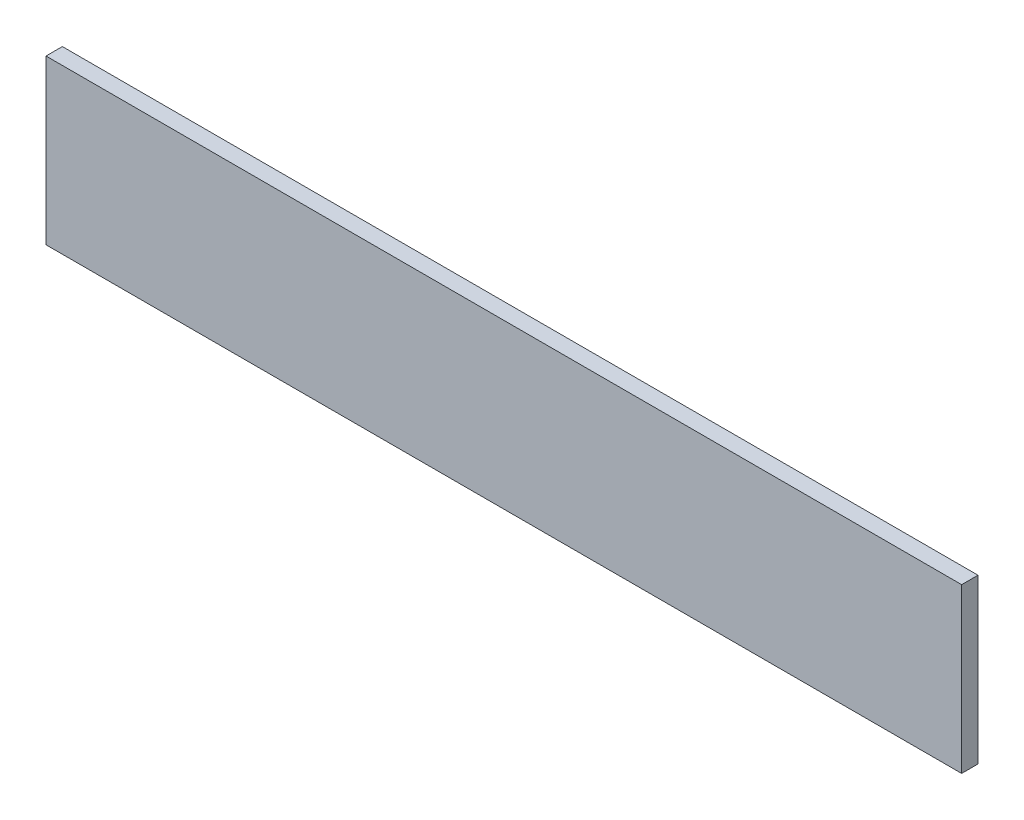
ISO-10303-21;
HEADER;
FILE_DESCRIPTION(('STEP AP214'),'2;1');
FILE_NAME('part.step','',(''),(''),'','','');
FILE_SCHEMA(('AUTOMOTIVE_DESIGN { 1 0 10303 214 1 1 1 1 }'));
ENDSEC;
DATA;
#1=APPLICATION_CONTEXT('core data for automotive mechanical design processes');
#2=APPLICATION_PROTOCOL_DEFINITION('international standard','automotive_design',2000,#1);
#3=PRODUCT_CONTEXT('',#1,'mechanical');
#4=PRODUCT('Part','Part','',(#3));
#5=PRODUCT_RELATED_PRODUCT_CATEGORY('part','',(#4));
#6=PRODUCT_DEFINITION_FORMATION('','',#4);
#7=PRODUCT_DEFINITION_CONTEXT('part definition',#1,'design');
#8=PRODUCT_DEFINITION('design','',#6,#7);
#9=PRODUCT_DEFINITION_SHAPE('','',#8);
#10=(LENGTH_UNIT() NAMED_UNIT(*) SI_UNIT(.MILLI.,.METRE.));
#11=(NAMED_UNIT(*) PLANE_ANGLE_UNIT() SI_UNIT($,.RADIAN.));
#12=(NAMED_UNIT(*) SI_UNIT($,.STERADIAN.) SOLID_ANGLE_UNIT());
#13=UNCERTAINTY_MEASURE_WITH_UNIT(LENGTH_MEASURE(1.E-05),#10,'distance_accuracy_value','');
#14=(GEOMETRIC_REPRESENTATION_CONTEXT(3) GLOBAL_UNCERTAINTY_ASSIGNED_CONTEXT((#13)) GLOBAL_UNIT_ASSIGNED_CONTEXT((#10,
#11,#12)) REPRESENTATION_CONTEXT('',''));
#15=CARTESIAN_POINT('',(0.,0.,0.));
#16=DIRECTION('',(0.,0.,1.));
#17=DIRECTION('',(1.,0.,0.));
#18=AXIS2_PLACEMENT_3D('',#15,#16,#17);
#19=CARTESIAN_POINT('',(140.,-25.,5.));
#20=DIRECTION('',(-1.,0.,0.));
#21=DIRECTION('',(0.,0.,1.));
#22=AXIS2_PLACEMENT_3D('',#19,#20,#21);
#23=PLANE('',#22);
#24=DIRECTION('',(0.,1.,0.));
#25=VECTOR('',#24,1.);
#26=CARTESIAN_POINT('',(140.,-25.,0.));
#27=LINE('',#26,#25);
#28=CARTESIAN_POINT('',(140.,-25.,0.));
#29=VERTEX_POINT('',#28);
#30=CARTESIAN_POINT('',(140.,25.,0.));
#31=VERTEX_POINT('',#30);
#32=EDGE_CURVE('E98',#29,#31,#27,.T.);
#33=ORIENTED_EDGE('',*,*,#32,.T.);
#34=DIRECTION('',(0.,0.,-1.));
#35=VECTOR('',#34,1.);
#36=CARTESIAN_POINT('',(140.,25.,5.));
#37=LINE('',#36,#35);
#38=CARTESIAN_POINT('',(140.,25.,5.));
#39=VERTEX_POINT('',#38);
#40=EDGE_CURVE('E11',#39,#31,#37,.T.);
#41=ORIENTED_EDGE('',*,*,#40,.F.);
#42=DIRECTION('',(0.,1.,0.));
#43=VECTOR('',#42,1.);
#44=CARTESIAN_POINT('',(140.,-25.,5.));
#45=LINE('',#44,#43);
#46=CARTESIAN_POINT('',(140.,-25.,5.));
#47=VERTEX_POINT('',#46);
#48=EDGE_CURVE('E86',#47,#39,#45,.T.);
#49=ORIENTED_EDGE('',*,*,#48,.F.);
#50=DIRECTION('',(0.,0.,-1.));
#51=VECTOR('',#50,1.);
#52=CARTESIAN_POINT('',(140.,-25.,5.));
#53=LINE('',#52,#51);
#54=EDGE_CURVE('E94',#47,#29,#53,.T.);
#55=ORIENTED_EDGE('',*,*,#54,.T.);
#56=EDGE_LOOP('',(#33,#41,#49,#55));
#57=FACE_BOUND('',#56,.T.);
#58=ADVANCED_FACE('F35',(#57),#23,.F.);
#59=CARTESIAN_POINT('',(-140.,25.,5.));
#60=DIRECTION('',(0.,-1.,0.));
#61=DIRECTION('',(0.,0.,-1.));
#62=AXIS2_PLACEMENT_3D('',#59,#60,#61);
#63=PLANE('',#62);
#64=DIRECTION('',(-1.,0.,0.));
#65=VECTOR('',#64,1.);
#66=CARTESIAN_POINT('',(-140.,25.,0.));
#67=LINE('',#66,#65);
#68=CARTESIAN_POINT('',(-140.,25.,0.));
#69=VERTEX_POINT('',#68);
#70=EDGE_CURVE('E90',#31,#69,#67,.T.);
#71=ORIENTED_EDGE('',*,*,#70,.T.);
#72=DIRECTION('',(0.,0.,-1.));
#73=VECTOR('',#72,1.);
#74=CARTESIAN_POINT('',(-140.,25.,5.));
#75=LINE('',#74,#73);
#76=CARTESIAN_POINT('',(-140.,25.,5.));
#77=VERTEX_POINT('',#76);
#78=EDGE_CURVE('E43',#77,#69,#75,.T.);
#79=ORIENTED_EDGE('',*,*,#78,.F.);
#80=DIRECTION('',(-1.,0.,0.));
#81=VECTOR('',#80,1.);
#82=CARTESIAN_POINT('',(-140.,25.,5.));
#83=LINE('',#82,#81);
#84=EDGE_CURVE('E81',#39,#77,#83,.T.);
#85=ORIENTED_EDGE('',*,*,#84,.F.);
#86=ORIENTED_EDGE('',*,*,#40,.T.);
#87=EDGE_LOOP('',(#71,#79,#85,#86));
#88=FACE_BOUND('',#87,.T.);
#89=ADVANCED_FACE('F89',(#88),#63,.F.);
#90=CARTESIAN_POINT('',(-140.,-25.,5.));
#91=DIRECTION('',(1.,0.,0.));
#92=DIRECTION('',(0.,0.,-1.));
#93=AXIS2_PLACEMENT_3D('',#90,#91,#92);
#94=PLANE('',#93);
#95=DIRECTION('',(0.,-1.,0.));
#96=VECTOR('',#95,1.);
#97=CARTESIAN_POINT('',(-140.,-25.,0.));
#98=LINE('',#97,#96);
#99=CARTESIAN_POINT('',(-140.,-25.,0.));
#100=VERTEX_POINT('',#99);
#101=EDGE_CURVE('E68',#69,#100,#98,.T.);
#102=ORIENTED_EDGE('',*,*,#101,.T.);
#103=DIRECTION('',(0.,0.,-1.));
#104=VECTOR('',#103,1.);
#105=CARTESIAN_POINT('',(-140.,-25.,5.));
#106=LINE('',#105,#104);
#107=CARTESIAN_POINT('',(-140.,-25.,5.));
#108=VERTEX_POINT('',#107);
#109=EDGE_CURVE('E91',#108,#100,#106,.T.);
#110=ORIENTED_EDGE('',*,*,#109,.F.);
#111=DIRECTION('',(0.,-1.,0.));
#112=VECTOR('',#111,1.);
#113=CARTESIAN_POINT('',(-140.,-25.,5.));
#114=LINE('',#113,#112);
#115=EDGE_CURVE('E84',#77,#108,#114,.T.);
#116=ORIENTED_EDGE('',*,*,#115,.F.);
#117=ORIENTED_EDGE('',*,*,#78,.T.);
#118=EDGE_LOOP('',(#102,#110,#116,#117));
#119=FACE_BOUND('',#118,.T.);
#120=ADVANCED_FACE('F92',(#119),#94,.F.);
#121=CARTESIAN_POINT('',(-140.,-25.,5.));
#122=DIRECTION('',(0.,1.,0.));
#123=DIRECTION('',(0.,0.,1.));
#124=AXIS2_PLACEMENT_3D('',#121,#122,#123);
#125=PLANE('',#124);
#126=DIRECTION('',(1.,0.,0.));
#127=VECTOR('',#126,1.);
#128=CARTESIAN_POINT('',(-140.,-25.,0.));
#129=LINE('',#128,#127);
#130=EDGE_CURVE('E74',#100,#29,#129,.T.);
#131=ORIENTED_EDGE('',*,*,#130,.T.);
#132=ORIENTED_EDGE('',*,*,#54,.F.);
#133=DIRECTION('',(1.,0.,0.));
#134=VECTOR('',#133,1.);
#135=CARTESIAN_POINT('',(-140.,-25.,5.));
#136=LINE('',#135,#134);
#137=EDGE_CURVE('E51',#108,#47,#136,.T.);
#138=ORIENTED_EDGE('',*,*,#137,.F.);
#139=ORIENTED_EDGE('',*,*,#109,.T.);
#140=EDGE_LOOP('',(#131,#132,#138,#139));
#141=FACE_BOUND('',#140,.T.);
#142=ADVANCED_FACE('F105',(#141),#125,.F.);
#143=CARTESIAN_POINT('',(0.,0.,5.));
#144=DIRECTION('',(0.,0.,-1.));
#145=DIRECTION('',(-1.,0.,0.));
#146=AXIS2_PLACEMENT_3D('',#143,#144,#145);
#147=PLANE('',#146);
#148=ORIENTED_EDGE('',*,*,#48,.T.);
#149=ORIENTED_EDGE('',*,*,#84,.T.);
#150=ORIENTED_EDGE('',*,*,#115,.T.);
#151=ORIENTED_EDGE('',*,*,#137,.T.);
#152=EDGE_LOOP('',(#148,#149,#150,#151));
#153=FACE_BOUND('',#152,.T.);
#154=ADVANCED_FACE('F82',(#153),#147,.F.);
#155=CARTESIAN_POINT('',(0.,0.,0.));
#156=DIRECTION('',(0.,0.,-1.));
#157=DIRECTION('',(-1.,0.,0.));
#158=AXIS2_PLACEMENT_3D('',#155,#156,#157);
#159=PLANE('',#158);
#160=ORIENTED_EDGE('',*,*,#32,.F.);
#161=ORIENTED_EDGE('',*,*,#130,.F.);
#162=ORIENTED_EDGE('',*,*,#101,.F.);
#163=ORIENTED_EDGE('',*,*,#70,.F.);
#164=EDGE_LOOP('',(#160,#161,#162,#163));
#165=FACE_BOUND('',#164,.T.);
#166=ADVANCED_FACE('F108',(#165),#159,.T.);
#167=CLOSED_SHELL('',(#58,#89,#120,#142,#154,#166));
#168=MANIFOLD_SOLID_BREP('B2',#167);
#169=ADVANCED_BREP_SHAPE_REPRESENTATION('',(#18,#168),#14);
#170=SHAPE_DEFINITION_REPRESENTATION(#9,#169);
ENDSEC;
END-ISO-10303-21;
